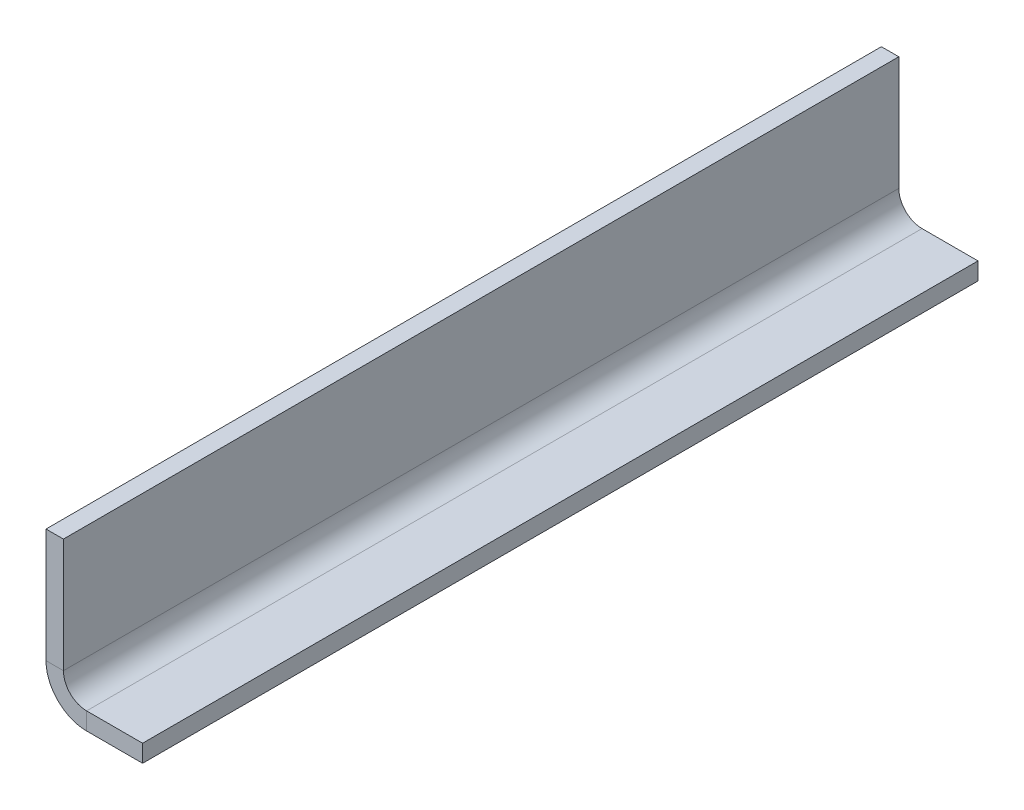
ISO-10303-21;
HEADER;
FILE_DESCRIPTION(('STEP AP214'),'2;1');
FILE_NAME('part.step','',(''),(''),'','','');
FILE_SCHEMA(('AUTOMOTIVE_DESIGN { 1 0 10303 214 1 1 1 1 }'));
ENDSEC;
DATA;
#1=APPLICATION_CONTEXT('core data for automotive mechanical design processes');
#2=APPLICATION_PROTOCOL_DEFINITION('international standard','automotive_design',2000,#1);
#3=PRODUCT_CONTEXT('',#1,'mechanical');
#4=PRODUCT('Part','Part','',(#3));
#5=PRODUCT_RELATED_PRODUCT_CATEGORY('part','',(#4));
#6=PRODUCT_DEFINITION_FORMATION('','',#4);
#7=PRODUCT_DEFINITION_CONTEXT('part definition',#1,'design');
#8=PRODUCT_DEFINITION('design','',#6,#7);
#9=PRODUCT_DEFINITION_SHAPE('','',#8);
#10=(LENGTH_UNIT() NAMED_UNIT(*) SI_UNIT(.MILLI.,.METRE.));
#11=(NAMED_UNIT(*) PLANE_ANGLE_UNIT() SI_UNIT($,.RADIAN.));
#12=(NAMED_UNIT(*) SI_UNIT($,.STERADIAN.) SOLID_ANGLE_UNIT());
#13=UNCERTAINTY_MEASURE_WITH_UNIT(LENGTH_MEASURE(1.E-05),#10,'distance_accuracy_value','');
#14=(GEOMETRIC_REPRESENTATION_CONTEXT(3) GLOBAL_UNCERTAINTY_ASSIGNED_CONTEXT((#13)) GLOBAL_UNIT_ASSIGNED_CONTEXT((#10,
#11,#12)) REPRESENTATION_CONTEXT('',''));
#15=CARTESIAN_POINT('',(0.,0.,0.));
#16=DIRECTION('',(0.,0.,1.));
#17=DIRECTION('',(1.,0.,0.));
#18=AXIS2_PLACEMENT_3D('',#15,#16,#17);
#19=CARTESIAN_POINT('',(3.175,3.175,0.));
#20=DIRECTION('',(0.,0.,1.));
#21=DIRECTION('',(0.,1.,0.));
#22=AXIS2_PLACEMENT_3D('',#19,#20,#21);
#23=PLANE('',#22);
#24=DIRECTION('',(1.,0.,0.));
#25=VECTOR('',#24,1.);
#26=CARTESIAN_POINT('',(3.175,5.175,0.));
#27=LINE('',#26,#25);
#28=CARTESIAN_POINT('',(1.675,5.175,0.));
#29=VERTEX_POINT('',#28);
#30=CARTESIAN_POINT('',(3.175,5.175,0.));
#31=VERTEX_POINT('',#30);
#32=EDGE_CURVE('E11',#29,#31,#27,.T.);
#33=ORIENTED_EDGE('',*,*,#32,.F.);
#34=DIRECTION('',(0.,-1.,0.));
#35=VECTOR('',#34,1.);
#36=CARTESIAN_POINT('',(1.675,3.175,0.));
#37=LINE('',#36,#35);
#38=CARTESIAN_POINT('',(1.675,15.,0.));
#39=VERTEX_POINT('',#38);
#40=EDGE_CURVE('E95',#29,#39,#37,.F.);
#41=ORIENTED_EDGE('',*,*,#40,.T.);
#42=DIRECTION('',(1.,0.,0.));
#43=VECTOR('',#42,1.);
#44=CARTESIAN_POINT('',(3.175,15.,0.));
#45=LINE('',#44,#43);
#46=CARTESIAN_POINT('',(3.175,15.,0.));
#47=VERTEX_POINT('',#46);
#48=EDGE_CURVE('E55',#39,#47,#45,.T.);
#49=ORIENTED_EDGE('',*,*,#48,.T.);
#50=DIRECTION('',(0.,1.,0.));
#51=VECTOR('',#50,1.);
#52=CARTESIAN_POINT('',(3.175,3.175,0.));
#53=LINE('',#52,#51);
#54=EDGE_CURVE('E98',#31,#47,#53,.T.);
#55=ORIENTED_EDGE('',*,*,#54,.F.);
#56=EDGE_LOOP('',(#33,#41,#49,#55));
#57=FACE_BOUND('',#56,.T.);
#58=ADVANCED_FACE('F45',(#57),#23,.F.);
#59=CARTESIAN_POINT('',(3.175,15.,72.));
#60=DIRECTION('',(0.,1.,0.));
#61=DIRECTION('',(0.,0.,-1.));
#62=AXIS2_PLACEMENT_3D('',#59,#60,#61);
#63=PLANE('',#62);
#64=ORIENTED_EDGE('',*,*,#48,.F.);
#65=DIRECTION('',(0.,0.,1.));
#66=VECTOR('',#65,1.);
#67=CARTESIAN_POINT('',(1.675,15.,72.));
#68=LINE('',#67,#66);
#69=CARTESIAN_POINT('',(1.675,15.,72.));
#70=VERTEX_POINT('',#69);
#71=EDGE_CURVE('E123',#70,#39,#68,.F.);
#72=ORIENTED_EDGE('',*,*,#71,.F.);
#73=DIRECTION('',(1.,0.,0.));
#74=VECTOR('',#73,1.);
#75=CARTESIAN_POINT('',(3.175,15.,72.));
#76=LINE('',#75,#74);
#77=CARTESIAN_POINT('',(3.175,15.,72.));
#78=VERTEX_POINT('',#77);
#79=EDGE_CURVE('E141',#70,#78,#76,.T.);
#80=ORIENTED_EDGE('',*,*,#79,.T.);
#81=DIRECTION('',(0.,0.,-1.));
#82=VECTOR('',#81,1.);
#83=CARTESIAN_POINT('',(3.175,15.,72.));
#84=LINE('',#83,#82);
#85=EDGE_CURVE('E152',#78,#47,#84,.T.);
#86=ORIENTED_EDGE('',*,*,#85,.T.);
#87=EDGE_LOOP('',(#64,#72,#80,#86));
#88=FACE_BOUND('',#87,.T.);
#89=ADVANCED_FACE('F158',(#88),#63,.T.);
#90=CARTESIAN_POINT('',(3.175,3.175,72.));
#91=DIRECTION('',(0.,0.,1.));
#92=DIRECTION('',(0.,1.,0.));
#93=AXIS2_PLACEMENT_3D('',#90,#91,#92);
#94=PLANE('',#93);
#95=ORIENTED_EDGE('',*,*,#79,.F.);
#96=DIRECTION('',(0.,-1.,0.));
#97=VECTOR('',#96,1.);
#98=CARTESIAN_POINT('',(1.675,3.175,72.));
#99=LINE('',#98,#97);
#100=CARTESIAN_POINT('',(1.675,5.175,72.));
#101=VERTEX_POINT('',#100);
#102=EDGE_CURVE('E183',#101,#70,#99,.F.);
#103=ORIENTED_EDGE('',*,*,#102,.F.);
#104=DIRECTION('',(1.,0.,0.));
#105=VECTOR('',#104,1.);
#106=CARTESIAN_POINT('',(3.175,5.175,72.));
#107=LINE('',#106,#105);
#108=CARTESIAN_POINT('',(3.175,5.175,72.));
#109=VERTEX_POINT('',#108);
#110=EDGE_CURVE('E138',#101,#109,#107,.T.);
#111=ORIENTED_EDGE('',*,*,#110,.T.);
#112=DIRECTION('',(0.,1.,0.));
#113=VECTOR('',#112,1.);
#114=CARTESIAN_POINT('',(3.175,3.175,72.));
#115=LINE('',#114,#113);
#116=EDGE_CURVE('E159',#109,#78,#115,.T.);
#117=ORIENTED_EDGE('',*,*,#116,.T.);
#118=EDGE_LOOP('',(#95,#103,#111,#117));
#119=FACE_BOUND('',#118,.T.);
#120=ADVANCED_FACE('F189',(#119),#94,.T.);
#121=CARTESIAN_POINT('',(5.175,5.175,72.));
#122=DIRECTION('',(0.,0.,1.));
#123=DIRECTION('',(1.,0.,0.));
#124=AXIS2_PLACEMENT_3D('',#121,#122,#123);
#125=PLANE('',#124);
#126=ORIENTED_EDGE('',*,*,#110,.F.);
#127=CARTESIAN_POINT('',(5.175,5.175,72.));
#128=DIRECTION('',(0.,0.,1.));
#129=DIRECTION('',(1.,0.,0.));
#130=AXIS2_PLACEMENT_3D('',#127,#128,#129);
#131=CIRCLE('',#130,3.5);
#132=CARTESIAN_POINT('',(5.175,1.675,72.));
#133=VERTEX_POINT('',#132);
#134=EDGE_CURVE('E113',#101,#133,#131,.T.);
#135=ORIENTED_EDGE('',*,*,#134,.T.);
#136=DIRECTION('',(0.,1.,0.));
#137=VECTOR('',#136,1.);
#138=CARTESIAN_POINT('',(5.175,3.175,72.));
#139=LINE('',#138,#137);
#140=CARTESIAN_POINT('',(5.175,3.175,72.));
#141=VERTEX_POINT('',#140);
#142=EDGE_CURVE('E63',#133,#141,#139,.T.);
#143=ORIENTED_EDGE('',*,*,#142,.T.);
#144=CARTESIAN_POINT('',(5.175,5.175,72.));
#145=DIRECTION('',(0.,0.,-1.));
#146=DIRECTION('',(-1.,0.,0.));
#147=AXIS2_PLACEMENT_3D('',#144,#145,#146);
#148=CIRCLE('',#147,2.);
#149=EDGE_CURVE('E156',#109,#141,#148,.F.);
#150=ORIENTED_EDGE('',*,*,#149,.F.);
#151=EDGE_LOOP('',(#126,#135,#143,#150));
#152=FACE_BOUND('',#151,.T.);
#153=ADVANCED_FACE('F192',(#152),#125,.T.);
#154=CARTESIAN_POINT('',(10.,3.175,72.));
#155=DIRECTION('',(0.,0.,1.));
#156=DIRECTION('',(-1.,0.,0.));
#157=AXIS2_PLACEMENT_3D('',#154,#155,#156);
#158=PLANE('',#157);
#159=ORIENTED_EDGE('',*,*,#142,.F.);
#160=DIRECTION('',(1.,0.,0.));
#161=VECTOR('',#160,1.);
#162=CARTESIAN_POINT('',(10.,1.675,72.));
#163=LINE('',#162,#161);
#164=CARTESIAN_POINT('',(10.,1.675,72.));
#165=VERTEX_POINT('',#164);
#166=EDGE_CURVE('E182',#165,#133,#163,.F.);
#167=ORIENTED_EDGE('',*,*,#166,.F.);
#168=DIRECTION('',(0.,1.,0.));
#169=VECTOR('',#168,1.);
#170=CARTESIAN_POINT('',(10.,3.175,72.));
#171=LINE('',#170,#169);
#172=CARTESIAN_POINT('',(10.,3.175,72.));
#173=VERTEX_POINT('',#172);
#174=EDGE_CURVE('E134',#165,#173,#171,.T.);
#175=ORIENTED_EDGE('',*,*,#174,.T.);
#176=DIRECTION('',(-1.,0.,0.));
#177=VECTOR('',#176,1.);
#178=CARTESIAN_POINT('',(10.,3.175,72.));
#179=LINE('',#178,#177);
#180=EDGE_CURVE('E166',#173,#141,#179,.T.);
#181=ORIENTED_EDGE('',*,*,#180,.T.);
#182=EDGE_LOOP('',(#159,#167,#175,#181));
#183=FACE_BOUND('',#182,.T.);
#184=ADVANCED_FACE('F203',(#183),#158,.T.);
#185=CARTESIAN_POINT('',(10.,3.175,72.));
#186=DIRECTION('',(-1.,0.,0.));
#187=DIRECTION('',(0.,0.,-1.));
#188=AXIS2_PLACEMENT_3D('',#185,#186,#187);
#189=PLANE('',#188);
#190=ORIENTED_EDGE('',*,*,#174,.F.);
#191=DIRECTION('',(0.,0.,1.));
#192=VECTOR('',#191,1.);
#193=CARTESIAN_POINT('',(10.,1.675,72.));
#194=LINE('',#193,#192);
#195=CARTESIAN_POINT('',(10.,1.675,0.));
#196=VERTEX_POINT('',#195);
#197=EDGE_CURVE('E118',#165,#196,#194,.F.);
#198=ORIENTED_EDGE('',*,*,#197,.T.);
#199=DIRECTION('',(0.,1.,0.));
#200=VECTOR('',#199,1.);
#201=CARTESIAN_POINT('',(10.,3.175,0.));
#202=LINE('',#201,#200);
#203=CARTESIAN_POINT('',(10.,3.175,0.));
#204=VERTEX_POINT('',#203);
#205=EDGE_CURVE('E131',#196,#204,#202,.T.);
#206=ORIENTED_EDGE('',*,*,#205,.T.);
#207=DIRECTION('',(0.,0.,-1.));
#208=VECTOR('',#207,1.);
#209=CARTESIAN_POINT('',(10.,3.175,72.));
#210=LINE('',#209,#208);
#211=EDGE_CURVE('E169',#173,#204,#210,.T.);
#212=ORIENTED_EDGE('',*,*,#211,.F.);
#213=EDGE_LOOP('',(#190,#198,#206,#212));
#214=FACE_BOUND('',#213,.T.);
#215=ADVANCED_FACE('F209',(#214),#189,.F.);
#216=CARTESIAN_POINT('',(10.,3.175,0.));
#217=DIRECTION('',(0.,0.,1.));
#218=DIRECTION('',(-1.,0.,0.));
#219=AXIS2_PLACEMENT_3D('',#216,#217,#218);
#220=PLANE('',#219);
#221=ORIENTED_EDGE('',*,*,#205,.F.);
#222=DIRECTION('',(1.,0.,0.));
#223=VECTOR('',#222,1.);
#224=CARTESIAN_POINT('',(10.,1.675,0.));
#225=LINE('',#224,#223);
#226=CARTESIAN_POINT('',(5.175,1.675,0.));
#227=VERTEX_POINT('',#226);
#228=EDGE_CURVE('E180',#196,#227,#225,.F.);
#229=ORIENTED_EDGE('',*,*,#228,.T.);
#230=DIRECTION('',(0.,1.,0.));
#231=VECTOR('',#230,1.);
#232=CARTESIAN_POINT('',(5.175,3.175,0.));
#233=LINE('',#232,#231);
#234=CARTESIAN_POINT('',(5.175,3.175,0.));
#235=VERTEX_POINT('',#234);
#236=EDGE_CURVE('E49',#227,#235,#233,.T.);
#237=ORIENTED_EDGE('',*,*,#236,.T.);
#238=DIRECTION('',(-1.,0.,0.));
#239=VECTOR('',#238,1.);
#240=CARTESIAN_POINT('',(10.,3.175,0.));
#241=LINE('',#240,#239);
#242=EDGE_CURVE('E161',#204,#235,#241,.T.);
#243=ORIENTED_EDGE('',*,*,#242,.F.);
#244=EDGE_LOOP('',(#221,#229,#237,#243));
#245=FACE_BOUND('',#244,.T.);
#246=ADVANCED_FACE('F213',(#245),#220,.F.);
#247=CARTESIAN_POINT('',(5.175,5.175,0.));
#248=DIRECTION('',(0.,0.,-1.));
#249=DIRECTION('',(-1.,0.,0.));
#250=AXIS2_PLACEMENT_3D('',#247,#248,#249);
#251=PLANE('',#250);
#252=CARTESIAN_POINT('',(5.175,5.175,0.));
#253=DIRECTION('',(0.,0.,1.));
#254=DIRECTION('',(1.,0.,0.));
#255=AXIS2_PLACEMENT_3D('',#252,#253,#254);
#256=CIRCLE('',#255,3.5);
#257=EDGE_CURVE('E111',#227,#29,#256,.F.);
#258=ORIENTED_EDGE('',*,*,#257,.T.);
#259=ORIENTED_EDGE('',*,*,#32,.T.);
#260=CARTESIAN_POINT('',(5.175,5.175,0.));
#261=DIRECTION('',(0.,0.,1.));
#262=DIRECTION('',(1.,0.,0.));
#263=AXIS2_PLACEMENT_3D('',#260,#261,#262);
#264=CIRCLE('',#263,2.);
#265=EDGE_CURVE('E176',#235,#31,#264,.F.);
#266=ORIENTED_EDGE('',*,*,#265,.F.);
#267=ORIENTED_EDGE('',*,*,#236,.F.);
#268=EDGE_LOOP('',(#258,#259,#266,#267));
#269=FACE_BOUND('',#268,.T.);
#270=ADVANCED_FACE('F47',(#269),#251,.T.);
#271=CARTESIAN_POINT('',(10.,3.175,72.));
#272=DIRECTION('',(0.,-1.,0.));
#273=DIRECTION('',(1.,0.,0.));
#274=AXIS2_PLACEMENT_3D('',#271,#272,#273);
#275=PLANE('',#274);
#276=ORIENTED_EDGE('',*,*,#242,.T.);
#277=DIRECTION('',(0.,0.,-1.));
#278=VECTOR('',#277,1.);
#279=CARTESIAN_POINT('',(5.175,3.175,72.));
#280=LINE('',#279,#278);
#281=EDGE_CURVE('E173',#235,#141,#280,.F.);
#282=ORIENTED_EDGE('',*,*,#281,.T.);
#283=ORIENTED_EDGE('',*,*,#180,.F.);
#284=ORIENTED_EDGE('',*,*,#211,.T.);
#285=EDGE_LOOP('',(#276,#282,#283,#284));
#286=FACE_BOUND('',#285,.T.);
#287=ADVANCED_FACE('F208',(#286),#275,.F.);
#288=CARTESIAN_POINT('',(3.175,3.175,72.));
#289=DIRECTION('',(-1.,0.,0.));
#290=DIRECTION('',(0.,-1.,0.));
#291=AXIS2_PLACEMENT_3D('',#288,#289,#290);
#292=PLANE('',#291);
#293=ORIENTED_EDGE('',*,*,#116,.F.);
#294=DIRECTION('',(0.,0.,-1.));
#295=VECTOR('',#294,1.);
#296=CARTESIAN_POINT('',(3.175,5.175,0.));
#297=LINE('',#296,#295);
#298=EDGE_CURVE('E155',#109,#31,#297,.T.);
#299=ORIENTED_EDGE('',*,*,#298,.T.);
#300=ORIENTED_EDGE('',*,*,#54,.T.);
#301=ORIENTED_EDGE('',*,*,#85,.F.);
#302=EDGE_LOOP('',(#293,#299,#300,#301));
#303=FACE_BOUND('',#302,.T.);
#304=ADVANCED_FACE('F151',(#303),#292,.F.);
#305=CARTESIAN_POINT('',(5.175,5.175,72.));
#306=DIRECTION('',(0.,0.,1.));
#307=DIRECTION('',(1.,0.,0.));
#308=AXIS2_PLACEMENT_3D('',#305,#306,#307);
#309=CYLINDRICAL_SURFACE('',#308,2.);
#310=ORIENTED_EDGE('',*,*,#149,.T.);
#311=ORIENTED_EDGE('',*,*,#281,.F.);
#312=ORIENTED_EDGE('',*,*,#265,.T.);
#313=ORIENTED_EDGE('',*,*,#298,.F.);
#314=EDGE_LOOP('',(#310,#311,#312,#313));
#315=FACE_BOUND('',#314,.T.);
#316=ADVANCED_FACE('F195',(#315),#309,.F.);
#317=CARTESIAN_POINT('',(10.,1.675,72.));
#318=DIRECTION('',(0.,-1.,0.));
#319=DIRECTION('',(1.,0.,0.));
#320=AXIS2_PLACEMENT_3D('',#317,#318,#319);
#321=PLANE('',#320);
#322=ORIENTED_EDGE('',*,*,#228,.F.);
#323=ORIENTED_EDGE('',*,*,#197,.F.);
#324=ORIENTED_EDGE('',*,*,#166,.T.);
#325=DIRECTION('',(0.,0.,1.));
#326=VECTOR('',#325,1.);
#327=CARTESIAN_POINT('',(5.175,1.675,72.));
#328=LINE('',#327,#326);
#329=EDGE_CURVE('E117',#227,#133,#328,.T.);
#330=ORIENTED_EDGE('',*,*,#329,.F.);
#331=EDGE_LOOP('',(#322,#323,#324,#330));
#332=FACE_BOUND('',#331,.T.);
#333=ADVANCED_FACE('F215',(#332),#321,.T.);
#334=CARTESIAN_POINT('',(1.675,3.175,72.));
#335=DIRECTION('',(-1.,0.,0.));
#336=DIRECTION('',(0.,-1.,0.));
#337=AXIS2_PLACEMENT_3D('',#334,#335,#336);
#338=PLANE('',#337);
#339=ORIENTED_EDGE('',*,*,#102,.T.);
#340=ORIENTED_EDGE('',*,*,#71,.T.);
#341=ORIENTED_EDGE('',*,*,#40,.F.);
#342=DIRECTION('',(0.,0.,1.));
#343=VECTOR('',#342,1.);
#344=CARTESIAN_POINT('',(1.675,5.175,72.));
#345=LINE('',#344,#343);
#346=EDGE_CURVE('E108',#101,#29,#345,.F.);
#347=ORIENTED_EDGE('',*,*,#346,.F.);
#348=EDGE_LOOP('',(#339,#340,#341,#347));
#349=FACE_BOUND('',#348,.T.);
#350=ADVANCED_FACE('F121',(#349),#338,.T.);
#351=CARTESIAN_POINT('',(5.175,5.175,72.));
#352=DIRECTION('',(0.,0.,1.));
#353=DIRECTION('',(1.,0.,0.));
#354=AXIS2_PLACEMENT_3D('',#351,#352,#353);
#355=CYLINDRICAL_SURFACE('',#354,3.5);
#356=ORIENTED_EDGE('',*,*,#134,.F.);
#357=ORIENTED_EDGE('',*,*,#346,.T.);
#358=ORIENTED_EDGE('',*,*,#257,.F.);
#359=ORIENTED_EDGE('',*,*,#329,.T.);
#360=EDGE_LOOP('',(#356,#357,#358,#359));
#361=FACE_BOUND('',#360,.T.);
#362=ADVANCED_FACE('F109',(#361),#355,.T.);
#363=CLOSED_SHELL('',(#58,#89,#120,#153,#184,#215,#246,#270,#287,#304,#316,#333,#350,#362));
#364=MANIFOLD_SOLID_BREP('B2',#363);
#365=ADVANCED_BREP_SHAPE_REPRESENTATION('',(#18,#364),#14);
#366=SHAPE_DEFINITION_REPRESENTATION(#9,#365);
ENDSEC;
END-ISO-10303-21;
